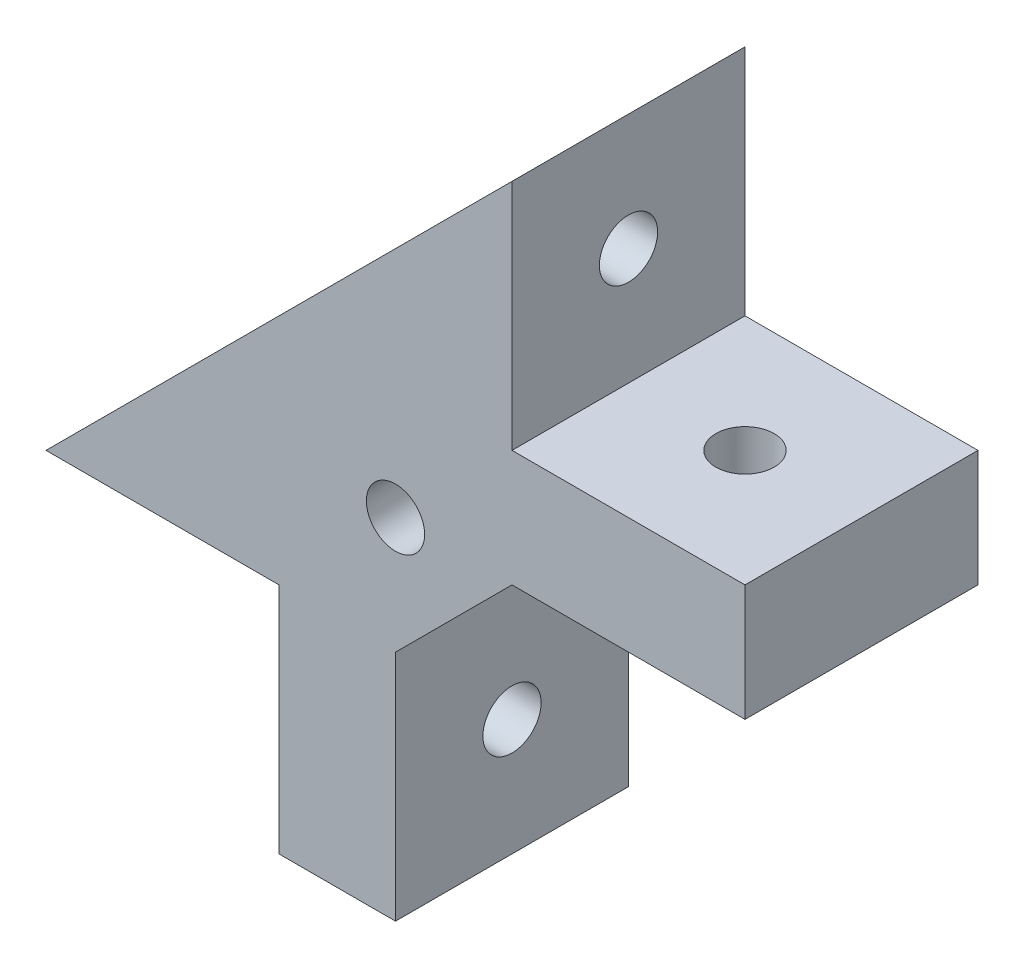
ISO-10303-21;
HEADER;
FILE_DESCRIPTION(('STEP AP214'),'2;1');
FILE_NAME('part.step','',(''),(''),'','','');
FILE_SCHEMA(('AUTOMOTIVE_DESIGN { 1 0 10303 214 1 1 1 1 }'));
ENDSEC;
DATA;
#1=APPLICATION_CONTEXT('core data for automotive mechanical design processes');
#2=APPLICATION_PROTOCOL_DEFINITION('international standard','automotive_design',2000,#1);
#3=PRODUCT_CONTEXT('',#1,'mechanical');
#4=PRODUCT('Part','Part','',(#3));
#5=PRODUCT_RELATED_PRODUCT_CATEGORY('part','',(#4));
#6=PRODUCT_DEFINITION_FORMATION('','',#4);
#7=PRODUCT_DEFINITION_CONTEXT('part definition',#1,'design');
#8=PRODUCT_DEFINITION('design','',#6,#7);
#9=PRODUCT_DEFINITION_SHAPE('','',#8);
#10=(LENGTH_UNIT() NAMED_UNIT(*) SI_UNIT(.MILLI.,.METRE.));
#11=(NAMED_UNIT(*) PLANE_ANGLE_UNIT() SI_UNIT($,.RADIAN.));
#12=(NAMED_UNIT(*) SI_UNIT($,.STERADIAN.) SOLID_ANGLE_UNIT());
#13=UNCERTAINTY_MEASURE_WITH_UNIT(LENGTH_MEASURE(1.E-05),#10,'distance_accuracy_value','');
#14=(GEOMETRIC_REPRESENTATION_CONTEXT(3) GLOBAL_UNCERTAINTY_ASSIGNED_CONTEXT((#13)) GLOBAL_UNIT_ASSIGNED_CONTEXT((#10,
#11,#12)) REPRESENTATION_CONTEXT('',''));
#15=CARTESIAN_POINT('',(0.,0.,0.));
#16=DIRECTION('',(0.,0.,1.));
#17=DIRECTION('',(1.,0.,0.));
#18=AXIS2_PLACEMENT_3D('',#15,#16,#17);
#19=CARTESIAN_POINT('',(0.,0.,10.));
#20=DIRECTION('',(0.,0.,-1.));
#21=DIRECTION('',(-1.,0.,0.));
#22=AXIS2_PLACEMENT_3D('',#19,#20,#21);
#23=PLANE('',#22);
#24=DIRECTION('',(1.,0.,0.));
#25=VECTOR('',#24,1.);
#26=CARTESIAN_POINT('',(0.,0.,10.));
#27=LINE('',#26,#25);
#28=CARTESIAN_POINT('',(0.,0.,10.));
#29=VERTEX_POINT('',#28);
#30=CARTESIAN_POINT('',(10.,0.,10.));
#31=VERTEX_POINT('',#30);
#32=EDGE_CURVE('E163',#29,#31,#27,.T.);
#33=ORIENTED_EDGE('',*,*,#32,.T.);
#34=DIRECTION('',(0.,-1.,0.));
#35=VECTOR('',#34,1.);
#36=CARTESIAN_POINT('',(10.,0.,10.));
#37=LINE('',#36,#35);
#38=CARTESIAN_POINT('',(10.,-10.,10.));
#39=VERTEX_POINT('',#38);
#40=EDGE_CURVE('E101',#31,#39,#37,.T.);
#41=ORIENTED_EDGE('',*,*,#40,.T.);
#42=DIRECTION('',(1.,0.,0.));
#43=VECTOR('',#42,1.);
#44=CARTESIAN_POINT('',(10.,-10.,10.));
#45=LINE('',#44,#43);
#46=CARTESIAN_POINT('',(15.,-10.,10.));
#47=VERTEX_POINT('',#46);
#48=EDGE_CURVE('E212',#39,#47,#45,.T.);
#49=ORIENTED_EDGE('',*,*,#48,.T.);
#50=DIRECTION('',(0.,1.,0.));
#51=VECTOR('',#50,1.);
#52=CARTESIAN_POINT('',(15.,-10.,10.));
#53=LINE('',#52,#51);
#54=CARTESIAN_POINT('',(15.,0.,10.));
#55=VERTEX_POINT('',#54);
#56=EDGE_CURVE('E214',#47,#55,#53,.T.);
#57=ORIENTED_EDGE('',*,*,#56,.T.);
#58=DIRECTION('',(0.707106781186546,0.707106781186549,0.));
#59=VECTOR('',#58,1.);
#60=CARTESIAN_POINT('',(15.,0.,10.));
#61=LINE('',#60,#59);
#62=CARTESIAN_POINT('',(20.,5.00000000000002,10.));
#63=VERTEX_POINT('',#62);
#64=EDGE_CURVE('E216',#55,#63,#61,.T.);
#65=ORIENTED_EDGE('',*,*,#64,.T.);
#66=DIRECTION('',(1.,0.,0.));
#67=VECTOR('',#66,1.);
#68=CARTESIAN_POINT('',(20.,5.00000000000002,10.));
#69=LINE('',#68,#67);
#70=CARTESIAN_POINT('',(30.,5.00000000000002,10.));
#71=VERTEX_POINT('',#70);
#72=EDGE_CURVE('E218',#63,#71,#69,.T.);
#73=ORIENTED_EDGE('',*,*,#72,.T.);
#74=DIRECTION('',(0.,1.,0.));
#75=VECTOR('',#74,1.);
#76=CARTESIAN_POINT('',(30.,10.0000000000001,10.));
#77=LINE('',#76,#75);
#78=CARTESIAN_POINT('',(30.,10.0000000000001,10.));
#79=VERTEX_POINT('',#78);
#80=EDGE_CURVE('E126',#71,#79,#77,.T.);
#81=ORIENTED_EDGE('',*,*,#80,.T.);
#82=DIRECTION('',(-1.,0.,0.));
#83=VECTOR('',#82,1.);
#84=CARTESIAN_POINT('',(20.,10.0000000000001,10.));
#85=LINE('',#84,#83);
#86=CARTESIAN_POINT('',(20.,10.0000000000001,10.));
#87=VERTEX_POINT('',#86);
#88=EDGE_CURVE('E120',#79,#87,#85,.T.);
#89=ORIENTED_EDGE('',*,*,#88,.T.);
#90=DIRECTION('',(0.,1.,0.));
#91=VECTOR('',#90,1.);
#92=CARTESIAN_POINT('',(20.,20.0000000000001,10.));
#93=LINE('',#92,#91);
#94=CARTESIAN_POINT('',(20.,20.0000000000001,10.));
#95=VERTEX_POINT('',#94);
#96=EDGE_CURVE('E124',#87,#95,#93,.T.);
#97=ORIENTED_EDGE('',*,*,#96,.T.);
#98=DIRECTION('',(-0.707106781186546,-0.707106781186549,0.));
#99=VECTOR('',#98,1.);
#100=CARTESIAN_POINT('',(0.,0.,10.));
#101=LINE('',#100,#99);
#102=EDGE_CURVE('E52',#95,#29,#101,.T.);
#103=ORIENTED_EDGE('',*,*,#102,.T.);
#104=EDGE_LOOP('',(#33,#41,#49,#57,#65,#73,#81,#89,#97,#103));
#105=FACE_BOUND('',#104,.T.);
#106=CARTESIAN_POINT('',(15.,5.00000000000002,10.));
#107=DIRECTION('',(0.,0.,1.));
#108=DIRECTION('',(1.,0.,0.));
#109=AXIS2_PLACEMENT_3D('',#106,#107,#108);
#110=CIRCLE('',#109,1.25);
#111=CARTESIAN_POINT('',(16.25,5.00000000000002,10.));
#112=VERTEX_POINT('',#111);
#113=EDGE_CURVE('E148',#112,#112,#110,.T.);
#114=ORIENTED_EDGE('',*,*,#113,.F.);
#115=EDGE_LOOP('',(#114));
#116=FACE_BOUND('',#115,.T.);
#117=ADVANCED_FACE('F33',(#105,#116),#23,.F.);
#118=CARTESIAN_POINT('',(0.,0.,0.));
#119=DIRECTION('',(0.,0.,-1.));
#120=DIRECTION('',(-1.,0.,0.));
#121=AXIS2_PLACEMENT_3D('',#118,#119,#120);
#122=PLANE('',#121);
#123=DIRECTION('',(1.,0.,0.));
#124=VECTOR('',#123,1.);
#125=CARTESIAN_POINT('',(0.,0.,0.));
#126=LINE('',#125,#124);
#127=CARTESIAN_POINT('',(0.,0.,0.));
#128=VERTEX_POINT('',#127);
#129=CARTESIAN_POINT('',(10.,0.,0.));
#130=VERTEX_POINT('',#129);
#131=EDGE_CURVE('E144',#128,#130,#126,.T.);
#132=ORIENTED_EDGE('',*,*,#131,.F.);
#133=DIRECTION('',(-0.707106781186546,-0.707106781186549,0.));
#134=VECTOR('',#133,1.);
#135=CARTESIAN_POINT('',(0.,0.,0.));
#136=LINE('',#135,#134);
#137=CARTESIAN_POINT('',(20.,20.0000000000001,0.));
#138=VERTEX_POINT('',#137);
#139=EDGE_CURVE('E93',#138,#128,#136,.T.);
#140=ORIENTED_EDGE('',*,*,#139,.F.);
#141=DIRECTION('',(0.,1.,0.));
#142=VECTOR('',#141,1.);
#143=CARTESIAN_POINT('',(20.,20.0000000000001,0.));
#144=LINE('',#143,#142);
#145=CARTESIAN_POINT('',(20.,10.0000000000001,0.));
#146=VERTEX_POINT('',#145);
#147=EDGE_CURVE('E87',#146,#138,#144,.T.);
#148=ORIENTED_EDGE('',*,*,#147,.F.);
#149=DIRECTION('',(-1.,0.,0.));
#150=VECTOR('',#149,1.);
#151=CARTESIAN_POINT('',(20.,10.0000000000001,0.));
#152=LINE('',#151,#150);
#153=CARTESIAN_POINT('',(30.,10.0000000000001,0.));
#154=VERTEX_POINT('',#153);
#155=EDGE_CURVE('E134',#154,#146,#152,.T.);
#156=ORIENTED_EDGE('',*,*,#155,.F.);
#157=DIRECTION('',(0.,1.,0.));
#158=VECTOR('',#157,1.);
#159=CARTESIAN_POINT('',(30.,10.0000000000001,0.));
#160=LINE('',#159,#158);
#161=CARTESIAN_POINT('',(30.,5.00000000000002,0.));
#162=VERTEX_POINT('',#161);
#163=EDGE_CURVE('E158',#162,#154,#160,.T.);
#164=ORIENTED_EDGE('',*,*,#163,.F.);
#165=DIRECTION('',(1.,0.,0.));
#166=VECTOR('',#165,1.);
#167=CARTESIAN_POINT('',(20.,5.00000000000002,0.));
#168=LINE('',#167,#166);
#169=CARTESIAN_POINT('',(20.,5.00000000000002,0.));
#170=VERTEX_POINT('',#169);
#171=EDGE_CURVE('E156',#170,#162,#168,.T.);
#172=ORIENTED_EDGE('',*,*,#171,.F.);
#173=DIRECTION('',(0.707106781186546,0.707106781186549,0.));
#174=VECTOR('',#173,1.);
#175=CARTESIAN_POINT('',(15.,0.,0.));
#176=LINE('',#175,#174);
#177=CARTESIAN_POINT('',(15.,0.,0.));
#178=VERTEX_POINT('',#177);
#179=EDGE_CURVE('E154',#178,#170,#176,.T.);
#180=ORIENTED_EDGE('',*,*,#179,.F.);
#181=DIRECTION('',(0.,1.,0.));
#182=VECTOR('',#181,1.);
#183=CARTESIAN_POINT('',(15.,-10.,0.));
#184=LINE('',#183,#182);
#185=CARTESIAN_POINT('',(15.,-10.,0.));
#186=VERTEX_POINT('',#185);
#187=EDGE_CURVE('E152',#186,#178,#184,.T.);
#188=ORIENTED_EDGE('',*,*,#187,.F.);
#189=DIRECTION('',(1.,0.,0.));
#190=VECTOR('',#189,1.);
#191=CARTESIAN_POINT('',(10.,-10.,0.));
#192=LINE('',#191,#190);
#193=CARTESIAN_POINT('',(10.,-10.,0.));
#194=VERTEX_POINT('',#193);
#195=EDGE_CURVE('E150',#194,#186,#192,.T.);
#196=ORIENTED_EDGE('',*,*,#195,.F.);
#197=DIRECTION('',(0.,-1.,0.));
#198=VECTOR('',#197,1.);
#199=CARTESIAN_POINT('',(10.,0.,0.));
#200=LINE('',#199,#198);
#201=EDGE_CURVE('E147',#130,#194,#200,.T.);
#202=ORIENTED_EDGE('',*,*,#201,.F.);
#203=EDGE_LOOP('',(#132,#140,#148,#156,#164,#172,#180,#188,#196,#202));
#204=FACE_BOUND('',#203,.T.);
#205=CARTESIAN_POINT('',(15.,5.00000000000002,0.));
#206=DIRECTION('',(0.,0.,1.));
#207=DIRECTION('',(1.,0.,0.));
#208=AXIS2_PLACEMENT_3D('',#205,#206,#207);
#209=CIRCLE('',#208,1.25);
#210=CARTESIAN_POINT('',(16.25,5.00000000000002,0.));
#211=VERTEX_POINT('',#210);
#212=EDGE_CURVE('E205',#211,#211,#209,.T.);
#213=ORIENTED_EDGE('',*,*,#212,.T.);
#214=EDGE_LOOP('',(#213));
#215=FACE_BOUND('',#214,.T.);
#216=ADVANCED_FACE('F231',(#204,#215),#122,.T.);
#217=CARTESIAN_POINT('',(0.,0.,10.));
#218=DIRECTION('',(0.,1.,0.));
#219=DIRECTION('',(0.,0.,1.));
#220=AXIS2_PLACEMENT_3D('',#217,#218,#219);
#221=PLANE('',#220);
#222=CARTESIAN_POINT('',(5.,0.,5.));
#223=DIRECTION('',(0.,-1.,0.));
#224=DIRECTION('',(0.,0.,-1.));
#225=AXIS2_PLACEMENT_3D('',#222,#223,#224);
#226=CIRCLE('',#225,1.25);
#227=CARTESIAN_POINT('',(5.,0.,3.75));
#228=VERTEX_POINT('',#227);
#229=EDGE_CURVE('E190',#228,#228,#226,.T.);
#230=ORIENTED_EDGE('',*,*,#229,.F.);
#231=EDGE_LOOP('',(#230));
#232=FACE_BOUND('',#231,.T.);
#233=ORIENTED_EDGE('',*,*,#131,.T.);
#234=DIRECTION('',(0.,0.,-1.));
#235=VECTOR('',#234,1.);
#236=CARTESIAN_POINT('',(10.,0.,10.));
#237=LINE('',#236,#235);
#238=EDGE_CURVE('E11',#31,#130,#237,.T.);
#239=ORIENTED_EDGE('',*,*,#238,.F.);
#240=ORIENTED_EDGE('',*,*,#32,.F.);
#241=DIRECTION('',(0.,0.,-1.));
#242=VECTOR('',#241,1.);
#243=CARTESIAN_POINT('',(0.,0.,10.));
#244=LINE('',#243,#242);
#245=EDGE_CURVE('E140',#29,#128,#244,.T.);
#246=ORIENTED_EDGE('',*,*,#245,.T.);
#247=EDGE_LOOP('',(#233,#239,#240,#246));
#248=FACE_BOUND('',#247,.T.);
#249=ADVANCED_FACE('F35',(#232,#248),#221,.F.);
#250=CARTESIAN_POINT('',(10.,0.,10.));
#251=DIRECTION('',(1.,0.,0.));
#252=DIRECTION('',(0.,1.,0.));
#253=AXIS2_PLACEMENT_3D('',#250,#251,#252);
#254=PLANE('',#253);
#255=CARTESIAN_POINT('',(10.,-5.,5.));
#256=DIRECTION('',(1.,0.,0.));
#257=DIRECTION('',(0.,1.,0.));
#258=AXIS2_PLACEMENT_3D('',#255,#256,#257);
#259=CIRCLE('',#258,1.25);
#260=CARTESIAN_POINT('',(10.,-3.75,5.));
#261=VERTEX_POINT('',#260);
#262=EDGE_CURVE('E184',#261,#261,#259,.T.);
#263=ORIENTED_EDGE('',*,*,#262,.T.);
#264=EDGE_LOOP('',(#263));
#265=FACE_BOUND('',#264,.T.);
#266=ORIENTED_EDGE('',*,*,#201,.T.);
#267=DIRECTION('',(0.,0.,-1.));
#268=VECTOR('',#267,1.);
#269=CARTESIAN_POINT('',(10.,-10.,10.));
#270=LINE('',#269,#268);
#271=EDGE_CURVE('E43',#39,#194,#270,.T.);
#272=ORIENTED_EDGE('',*,*,#271,.F.);
#273=ORIENTED_EDGE('',*,*,#40,.F.);
#274=ORIENTED_EDGE('',*,*,#238,.T.);
#275=EDGE_LOOP('',(#266,#272,#273,#274));
#276=FACE_BOUND('',#275,.T.);
#277=ADVANCED_FACE('F296',(#265,#276),#254,.F.);
#278=CARTESIAN_POINT('',(10.,-10.,10.));
#279=DIRECTION('',(0.,1.,0.));
#280=DIRECTION('',(0.,0.,1.));
#281=AXIS2_PLACEMENT_3D('',#278,#279,#280);
#282=PLANE('',#281);
#283=ORIENTED_EDGE('',*,*,#195,.T.);
#284=DIRECTION('',(0.,0.,-1.));
#285=VECTOR('',#284,1.);
#286=CARTESIAN_POINT('',(15.,-10.,10.));
#287=LINE('',#286,#285);
#288=EDGE_CURVE('E176',#47,#186,#287,.T.);
#289=ORIENTED_EDGE('',*,*,#288,.F.);
#290=ORIENTED_EDGE('',*,*,#48,.F.);
#291=ORIENTED_EDGE('',*,*,#271,.T.);
#292=EDGE_LOOP('',(#283,#289,#290,#291));
#293=FACE_BOUND('',#292,.T.);
#294=ADVANCED_FACE('F293',(#293),#282,.F.);
#295=CARTESIAN_POINT('',(15.,-10.,10.));
#296=DIRECTION('',(-1.,0.,0.));
#297=DIRECTION('',(0.,0.,1.));
#298=AXIS2_PLACEMENT_3D('',#295,#296,#297);
#299=PLANE('',#298);
#300=CARTESIAN_POINT('',(15.,-5.,5.));
#301=DIRECTION('',(-1.,0.,0.));
#302=DIRECTION('',(0.,0.,1.));
#303=AXIS2_PLACEMENT_3D('',#300,#301,#302);
#304=CIRCLE('',#303,1.25);
#305=CARTESIAN_POINT('',(15.,-5.,6.25));
#306=VERTEX_POINT('',#305);
#307=EDGE_CURVE('E181',#306,#306,#304,.T.);
#308=ORIENTED_EDGE('',*,*,#307,.T.);
#309=EDGE_LOOP('',(#308));
#310=FACE_BOUND('',#309,.T.);
#311=ORIENTED_EDGE('',*,*,#187,.T.);
#312=DIRECTION('',(0.,0.,-1.));
#313=VECTOR('',#312,1.);
#314=CARTESIAN_POINT('',(15.,0.,10.));
#315=LINE('',#314,#313);
#316=EDGE_CURVE('E173',#55,#178,#315,.T.);
#317=ORIENTED_EDGE('',*,*,#316,.F.);
#318=ORIENTED_EDGE('',*,*,#56,.F.);
#319=ORIENTED_EDGE('',*,*,#288,.T.);
#320=EDGE_LOOP('',(#311,#317,#318,#319));
#321=FACE_BOUND('',#320,.T.);
#322=ADVANCED_FACE('F286',(#310,#321),#299,.F.);
#323=CARTESIAN_POINT('',(15.,0.,10.));
#324=DIRECTION('',(-0.707106781186549,0.707106781186546,0.));
#325=DIRECTION('',(-0.707106781186546,-0.707106781186549,0.));
#326=AXIS2_PLACEMENT_3D('',#323,#324,#325);
#327=PLANE('',#326);
#328=ORIENTED_EDGE('',*,*,#179,.T.);
#329=DIRECTION('',(0.,0.,-1.));
#330=VECTOR('',#329,1.);
#331=CARTESIAN_POINT('',(20.,5.00000000000002,10.));
#332=LINE('',#331,#330);
#333=EDGE_CURVE('E170',#63,#170,#332,.T.);
#334=ORIENTED_EDGE('',*,*,#333,.F.);
#335=ORIENTED_EDGE('',*,*,#64,.F.);
#336=ORIENTED_EDGE('',*,*,#316,.T.);
#337=EDGE_LOOP('',(#328,#334,#335,#336));
#338=FACE_BOUND('',#337,.T.);
#339=ADVANCED_FACE('F279',(#338),#327,.F.);
#340=CARTESIAN_POINT('',(20.,5.00000000000002,10.));
#341=DIRECTION('',(0.,1.,0.));
#342=DIRECTION('',(-1.,0.,0.));
#343=AXIS2_PLACEMENT_3D('',#340,#341,#342);
#344=PLANE('',#343);
#345=CARTESIAN_POINT('',(25.,5.00000000000002,5.));
#346=DIRECTION('',(0.,1.,0.));
#347=DIRECTION('',(-1.,0.,0.));
#348=AXIS2_PLACEMENT_3D('',#345,#346,#347);
#349=CIRCLE('',#348,1.25);
#350=CARTESIAN_POINT('',(23.75,5.00000000000002,5.));
#351=VERTEX_POINT('',#350);
#352=EDGE_CURVE('E196',#351,#351,#349,.T.);
#353=ORIENTED_EDGE('',*,*,#352,.T.);
#354=EDGE_LOOP('',(#353));
#355=FACE_BOUND('',#354,.T.);
#356=ORIENTED_EDGE('',*,*,#171,.T.);
#357=DIRECTION('',(0.,0.,-1.));
#358=VECTOR('',#357,1.);
#359=CARTESIAN_POINT('',(30.,5.00000000000002,10.));
#360=LINE('',#359,#358);
#361=EDGE_CURVE('E167',#71,#162,#360,.T.);
#362=ORIENTED_EDGE('',*,*,#361,.F.);
#363=ORIENTED_EDGE('',*,*,#72,.F.);
#364=ORIENTED_EDGE('',*,*,#333,.T.);
#365=EDGE_LOOP('',(#356,#362,#363,#364));
#366=FACE_BOUND('',#365,.T.);
#367=ADVANCED_FACE('F224',(#355,#366),#344,.F.);
#368=CARTESIAN_POINT('',(30.,10.0000000000001,10.));
#369=DIRECTION('',(-1.,0.,0.));
#370=DIRECTION('',(0.,-1.,0.));
#371=AXIS2_PLACEMENT_3D('',#368,#369,#370);
#372=PLANE('',#371);
#373=ORIENTED_EDGE('',*,*,#163,.T.);
#374=DIRECTION('',(0.,0.,-1.));
#375=VECTOR('',#374,1.);
#376=CARTESIAN_POINT('',(30.,10.0000000000001,10.));
#377=LINE('',#376,#375);
#378=EDGE_CURVE('E135',#79,#154,#377,.T.);
#379=ORIENTED_EDGE('',*,*,#378,.F.);
#380=ORIENTED_EDGE('',*,*,#80,.F.);
#381=ORIENTED_EDGE('',*,*,#361,.T.);
#382=EDGE_LOOP('',(#373,#379,#380,#381));
#383=FACE_BOUND('',#382,.T.);
#384=ADVANCED_FACE('F228',(#383),#372,.F.);
#385=CARTESIAN_POINT('',(20.,10.0000000000001,10.));
#386=DIRECTION('',(0.,-1.,0.));
#387=DIRECTION('',(1.,0.,0.));
#388=AXIS2_PLACEMENT_3D('',#385,#386,#387);
#389=PLANE('',#388);
#390=CARTESIAN_POINT('',(25.,10.0000000000001,5.));
#391=DIRECTION('',(0.,-1.,0.));
#392=DIRECTION('',(1.,0.,0.));
#393=AXIS2_PLACEMENT_3D('',#390,#391,#392);
#394=CIRCLE('',#393,1.25);
#395=CARTESIAN_POINT('',(26.25,10.0000000000001,5.));
#396=VERTEX_POINT('',#395);
#397=EDGE_CURVE('E37',#396,#396,#394,.T.);
#398=ORIENTED_EDGE('',*,*,#397,.T.);
#399=EDGE_LOOP('',(#398));
#400=FACE_BOUND('',#399,.T.);
#401=ORIENTED_EDGE('',*,*,#155,.T.);
#402=DIRECTION('',(0.,0.,-1.));
#403=VECTOR('',#402,1.);
#404=CARTESIAN_POINT('',(20.,10.0000000000001,10.));
#405=LINE('',#404,#403);
#406=EDGE_CURVE('E131',#87,#146,#405,.T.);
#407=ORIENTED_EDGE('',*,*,#406,.F.);
#408=ORIENTED_EDGE('',*,*,#88,.F.);
#409=ORIENTED_EDGE('',*,*,#378,.T.);
#410=EDGE_LOOP('',(#401,#407,#408,#409));
#411=FACE_BOUND('',#410,.T.);
#412=ADVANCED_FACE('F132',(#400,#411),#389,.F.);
#413=CARTESIAN_POINT('',(20.,20.0000000000001,10.));
#414=DIRECTION('',(-1.,0.,0.));
#415=DIRECTION('',(0.,-1.,0.));
#416=AXIS2_PLACEMENT_3D('',#413,#414,#415);
#417=PLANE('',#416);
#418=CARTESIAN_POINT('',(20.,15.0000000000001,5.));
#419=DIRECTION('',(1.,0.,0.));
#420=DIRECTION('',(0.,1.,0.));
#421=AXIS2_PLACEMENT_3D('',#418,#419,#420);
#422=CIRCLE('',#421,1.25);
#423=CARTESIAN_POINT('',(20.,16.2500000000001,5.));
#424=VERTEX_POINT('',#423);
#425=EDGE_CURVE('E187',#424,#424,#422,.T.);
#426=ORIENTED_EDGE('',*,*,#425,.F.);
#427=EDGE_LOOP('',(#426));
#428=FACE_BOUND('',#427,.T.);
#429=ORIENTED_EDGE('',*,*,#147,.T.);
#430=DIRECTION('',(0.,0.,-1.));
#431=VECTOR('',#430,1.);
#432=CARTESIAN_POINT('',(20.,20.0000000000001,10.));
#433=LINE('',#432,#431);
#434=EDGE_CURVE('E136',#95,#138,#433,.T.);
#435=ORIENTED_EDGE('',*,*,#434,.F.);
#436=ORIENTED_EDGE('',*,*,#96,.F.);
#437=ORIENTED_EDGE('',*,*,#406,.T.);
#438=EDGE_LOOP('',(#429,#435,#436,#437));
#439=FACE_BOUND('',#438,.T.);
#440=ADVANCED_FACE('F138',(#428,#439),#417,.F.);
#441=CARTESIAN_POINT('',(0.,0.,10.));
#442=DIRECTION('',(0.707106781186549,-0.707106781186546,0.));
#443=DIRECTION('',(0.707106781186546,0.707106781186549,0.));
#444=AXIS2_PLACEMENT_3D('',#441,#442,#443);
#445=PLANE('',#444);
#446=CARTESIAN_POINT('',(5.,5.00000000000002,5.));
#447=DIRECTION('',(0.707106781186549,-0.707106781186546,0.));
#448=DIRECTION('',(-0.707106781186546,-0.707106781186549,0.));
#449=AXIS2_PLACEMENT_3D('',#446,#447,#448);
#450=ELLIPSE('',#449,1.76776695296637,1.25);
#451=CARTESIAN_POINT('',(3.75,3.75000000000001,5.));
#452=VERTEX_POINT('',#451);
#453=EDGE_CURVE('E188',#452,#452,#450,.T.);
#454=ORIENTED_EDGE('',*,*,#453,.T.);
#455=EDGE_LOOP('',(#454));
#456=FACE_BOUND('',#455,.T.);
#457=CARTESIAN_POINT('',(15.,15.0000000000001,5.));
#458=DIRECTION('',(0.707106781186549,-0.707106781186546,0.));
#459=DIRECTION('',(0.707106781186546,0.707106781186549,0.));
#460=AXIS2_PLACEMENT_3D('',#457,#458,#459);
#461=ELLIPSE('',#460,1.76776695296637,1.25);
#462=CARTESIAN_POINT('',(16.25,16.2500000000001,5.));
#463=VERTEX_POINT('',#462);
#464=EDGE_CURVE('E185',#463,#463,#461,.T.);
#465=ORIENTED_EDGE('',*,*,#464,.T.);
#466=EDGE_LOOP('',(#465));
#467=FACE_BOUND('',#466,.T.);
#468=ORIENTED_EDGE('',*,*,#139,.T.);
#469=ORIENTED_EDGE('',*,*,#245,.F.);
#470=ORIENTED_EDGE('',*,*,#102,.F.);
#471=ORIENTED_EDGE('',*,*,#434,.T.);
#472=EDGE_LOOP('',(#468,#469,#470,#471));
#473=FACE_BOUND('',#472,.T.);
#474=ADVANCED_FACE('F237',(#456,#467,#473),#445,.F.);
#475=CARTESIAN_POINT('',(15.,5.00000000000002,10.));
#476=DIRECTION('',(0.,0.,-1.));
#477=DIRECTION('',(-1.,0.,0.));
#478=AXIS2_PLACEMENT_3D('',#475,#476,#477);
#479=CYLINDRICAL_SURFACE('',#478,1.25);
#480=ORIENTED_EDGE('',*,*,#113,.T.);
#481=EDGE_LOOP('',(#480));
#482=FACE_BOUND('',#481,.T.);
#483=ORIENTED_EDGE('',*,*,#212,.F.);
#484=EDGE_LOOP('',(#483));
#485=FACE_BOUND('',#484,.T.);
#486=ADVANCED_FACE('F239',(#482,#485),#479,.F.);
#487=CARTESIAN_POINT('',(0.,-5.,5.));
#488=DIRECTION('',(1.,0.,0.));
#489=DIRECTION('',(0.,1.,0.));
#490=AXIS2_PLACEMENT_3D('',#487,#488,#489);
#491=CYLINDRICAL_SURFACE('',#490,1.25);
#492=ORIENTED_EDGE('',*,*,#307,.F.);
#493=EDGE_LOOP('',(#492));
#494=FACE_BOUND('',#493,.T.);
#495=ORIENTED_EDGE('',*,*,#262,.F.);
#496=EDGE_LOOP('',(#495));
#497=FACE_BOUND('',#496,.T.);
#498=ADVANCED_FACE('F245',(#494,#497),#491,.F.);
#499=CARTESIAN_POINT('',(0.,15.0000000000001,5.));
#500=DIRECTION('',(1.,0.,0.));
#501=DIRECTION('',(0.,1.,0.));
#502=AXIS2_PLACEMENT_3D('',#499,#500,#501);
#503=CYLINDRICAL_SURFACE('',#502,1.25);
#504=ORIENTED_EDGE('',*,*,#425,.T.);
#505=EDGE_LOOP('',(#504));
#506=FACE_BOUND('',#505,.T.);
#507=ORIENTED_EDGE('',*,*,#464,.F.);
#508=EDGE_LOOP('',(#507));
#509=FACE_BOUND('',#508,.T.);
#510=ADVANCED_FACE('F260',(#506,#509),#503,.F.);
#511=CARTESIAN_POINT('',(5.,20.0000000000001,5.));
#512=DIRECTION('',(0.,-1.,0.));
#513=DIRECTION('',(0.,0.,-1.));
#514=AXIS2_PLACEMENT_3D('',#511,#512,#513);
#515=CYLINDRICAL_SURFACE('',#514,1.25);
#516=ORIENTED_EDGE('',*,*,#229,.T.);
#517=EDGE_LOOP('',(#516));
#518=FACE_BOUND('',#517,.T.);
#519=ORIENTED_EDGE('',*,*,#453,.F.);
#520=EDGE_LOOP('',(#519));
#521=FACE_BOUND('',#520,.T.);
#522=ADVANCED_FACE('F264',(#518,#521),#515,.F.);
#523=CARTESIAN_POINT('',(25.,20.0000000000001,5.));
#524=DIRECTION('',(0.,-1.,0.));
#525=DIRECTION('',(0.,0.,-1.));
#526=AXIS2_PLACEMENT_3D('',#523,#524,#525);
#527=CYLINDRICAL_SURFACE('',#526,1.25);
#528=ORIENTED_EDGE('',*,*,#397,.F.);
#529=EDGE_LOOP('',(#528));
#530=FACE_BOUND('',#529,.T.);
#531=ORIENTED_EDGE('',*,*,#352,.F.);
#532=EDGE_LOOP('',(#531));
#533=FACE_BOUND('',#532,.T.);
#534=ADVANCED_FACE('F268',(#530,#533),#527,.F.);
#535=CLOSED_SHELL('',(#117,#216,#249,#277,#294,#322,#339,#367,#384,#412,#440,#474,#486,#498,
#510,#522,#534));
#536=MANIFOLD_SOLID_BREP('B2',#535);
#537=ADVANCED_BREP_SHAPE_REPRESENTATION('',(#18,#536),#14);
#538=SHAPE_DEFINITION_REPRESENTATION(#9,#537);
ENDSEC;
END-ISO-10303-21;
